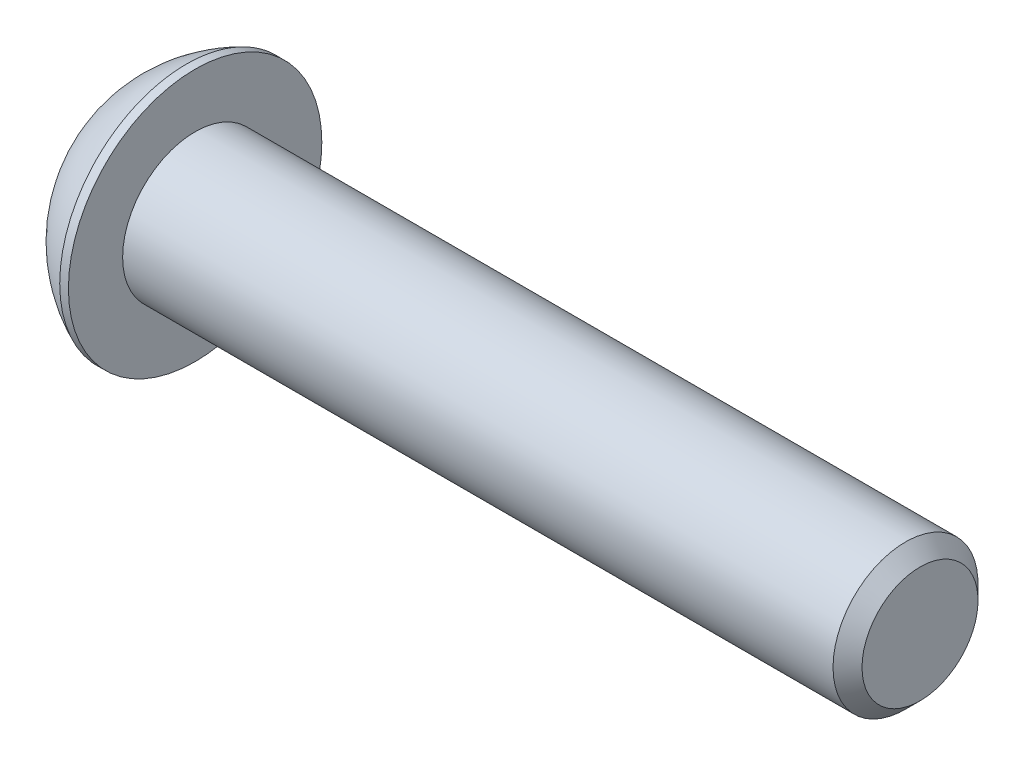
ISO-10303-21;
HEADER;
FILE_DESCRIPTION(('STEP AP214'),'2;1');
FILE_NAME('part.step','',(''),(''),'','','');
FILE_SCHEMA(('AUTOMOTIVE_DESIGN { 1 0 10303 214 1 1 1 1 }'));
ENDSEC;
DATA;
#1=APPLICATION_CONTEXT('core data for automotive mechanical design processes');
#2=APPLICATION_PROTOCOL_DEFINITION('international standard','automotive_design',2000,#1);
#3=PRODUCT_CONTEXT('',#1,'mechanical');
#4=PRODUCT('Part','Part','',(#3));
#5=PRODUCT_RELATED_PRODUCT_CATEGORY('part','',(#4));
#6=PRODUCT_DEFINITION_FORMATION('','',#4);
#7=PRODUCT_DEFINITION_CONTEXT('part definition',#1,'design');
#8=PRODUCT_DEFINITION('design','',#6,#7);
#9=PRODUCT_DEFINITION_SHAPE('','',#8);
#10=(LENGTH_UNIT() NAMED_UNIT(*) SI_UNIT(.MILLI.,.METRE.));
#11=(NAMED_UNIT(*) PLANE_ANGLE_UNIT() SI_UNIT($,.RADIAN.));
#12=(NAMED_UNIT(*) SI_UNIT($,.STERADIAN.) SOLID_ANGLE_UNIT());
#13=UNCERTAINTY_MEASURE_WITH_UNIT(LENGTH_MEASURE(1.E-05),#10,'distance_accuracy_value','');
#14=(GEOMETRIC_REPRESENTATION_CONTEXT(3) GLOBAL_UNCERTAINTY_ASSIGNED_CONTEXT((#13)) GLOBAL_UNIT_ASSIGNED_CONTEXT((#10,
#11,#12)) REPRESENTATION_CONTEXT('',''));
#15=CARTESIAN_POINT('',(0.,0.,0.));
#16=DIRECTION('',(0.,0.,1.));
#17=DIRECTION('',(1.,0.,0.));
#18=AXIS2_PLACEMENT_3D('',#15,#16,#17);
#19=CARTESIAN_POINT('',(1.32080000000034,0.,0.));
#20=DIRECTION('',(-1.,0.,0.));
#21=DIRECTION('',(0.,0.,1.));
#22=AXIS2_PLACEMENT_3D('',#19,#20,#21);
#23=CONICAL_SURFACE('',#22,1.1937999999998,1.04719755119608);
#24=CARTESIAN_POINT('',(2.01004075135902,0.,-4.44089209850063E-13));
#25=VERTEX_POINT('',#24);
#26=VERTEX_LOOP('',#25);
#27=FACE_BOUND('',#26,.T.);
#28=CARTESIAN_POINT('',(1.32080000000009,0.,0.));
#29=DIRECTION('',(-1.,0.,0.));
#30=DIRECTION('',(0.,0.,1.));
#31=AXIS2_PLACEMENT_3D('',#28,#29,#30);
#32=CIRCLE('',#31,1.19380000000024);
#33=CARTESIAN_POINT('',(1.32080000000009,0.,1.19380000000024));
#34=VERTEX_POINT('',#33);
#35=EDGE_CURVE('E20',#34,#34,#32,.T.);
#36=ORIENTED_EDGE('',*,*,#35,.T.);
#37=EDGE_LOOP('',(#36));
#38=FACE_BOUND('',#37,.T.);
#39=ADVANCED_FACE('F17',(#27,#38),#23,.F.);
#40=CARTESIAN_POINT('',(1.3208,-2.29135888084633,0.));
#41=DIRECTION('',(1.,0.,0.));
#42=DIRECTION('',(0.,0.,-1.));
#43=AXIS2_PLACEMENT_3D('',#40,#41,#42);
#44=PLANE('',#43);
#45=DIRECTION('',(0.,1.,0.));
#46=VECTOR('',#45,1.);
#47=CARTESIAN_POINT('',(1.3208,-1.14567944042316,1.984375));
#48=LINE('',#47,#46);
#49=CARTESIAN_POINT('',(1.3208,1.14567944042316,1.984375));
#50=VERTEX_POINT('',#49);
#51=CARTESIAN_POINT('',(1.3208,-1.14567944042316,1.984375));
#52=VERTEX_POINT('',#51);
#53=EDGE_CURVE('E69',#50,#52,#48,.F.);
#54=ORIENTED_EDGE('',*,*,#53,.F.);
#55=DIRECTION('',(0.,0.5,-0.866025403784439));
#56=VECTOR('',#55,1.);
#57=CARTESIAN_POINT('',(1.3208,1.14567944042316,1.984375));
#58=LINE('',#57,#56);
#59=CARTESIAN_POINT('',(1.3208,2.29135888084633,0.));
#60=VERTEX_POINT('',#59);
#61=EDGE_CURVE('E293',#60,#50,#58,.F.);
#62=ORIENTED_EDGE('',*,*,#61,.F.);
#63=DIRECTION('',(0.,-0.5,-0.866025403784439));
#64=VECTOR('',#63,1.);
#65=CARTESIAN_POINT('',(1.3208,2.29135888084633,0.));
#66=LINE('',#65,#64);
#67=CARTESIAN_POINT('',(1.3208,1.14567944042316,-1.984375));
#68=VERTEX_POINT('',#67);
#69=EDGE_CURVE('E297',#68,#60,#66,.F.);
#70=ORIENTED_EDGE('',*,*,#69,.F.);
#71=DIRECTION('',(0.,1.,0.));
#72=VECTOR('',#71,1.);
#73=CARTESIAN_POINT('',(1.3208,1.14567944042316,-1.984375));
#74=LINE('',#73,#72);
#75=CARTESIAN_POINT('',(1.3208,-1.14567944042316,-1.984375));
#76=VERTEX_POINT('',#75);
#77=EDGE_CURVE('E302',#76,#68,#74,.T.);
#78=ORIENTED_EDGE('',*,*,#77,.F.);
#79=DIRECTION('',(0.,-0.500000000000001,0.866025403784438));
#80=VECTOR('',#79,1.);
#81=CARTESIAN_POINT('',(1.3208,-1.14567944042316,-1.984375));
#82=LINE('',#81,#80);
#83=CARTESIAN_POINT('',(1.3208,-2.29135888084633,0.));
#84=VERTEX_POINT('',#83);
#85=EDGE_CURVE('E307',#84,#76,#82,.F.);
#86=ORIENTED_EDGE('',*,*,#85,.F.);
#87=DIRECTION('',(0.,0.500000000000001,0.866025403784438));
#88=VECTOR('',#87,1.);
#89=CARTESIAN_POINT('',(1.3208,-2.29135888084633,0.));
#90=LINE('',#89,#88);
#91=EDGE_CURVE('E82',#52,#84,#90,.F.);
#92=ORIENTED_EDGE('',*,*,#91,.F.);
#93=EDGE_LOOP('',(#54,#62,#70,#78,#86,#92));
#94=FACE_BOUND('',#93,.T.);
#95=ORIENTED_EDGE('',*,*,#35,.F.);
#96=EDGE_LOOP('',(#95));
#97=FACE_BOUND('',#96,.T.);
#98=ADVANCED_FACE('F75',(#94,#97),#44,.F.);
#99=CARTESIAN_POINT('',(1.3208,-1.14567944042316,1.984375));
#100=DIRECTION('',(0.,0.,-1.));
#101=DIRECTION('',(0.,1.,0.));
#102=AXIS2_PLACEMENT_3D('',#99,#100,#101);
#103=PLANE('',#102);
#104=ORIENTED_EDGE('',*,*,#53,.T.);
#105=DIRECTION('',(1.,0.,0.));
#106=VECTOR('',#105,1.);
#107=CARTESIAN_POINT('',(1.3208,-1.14567944042316,1.984375));
#108=LINE('',#107,#106);
#109=CARTESIAN_POINT('',(0.,-1.14567944042316,1.984375));
#110=VERTEX_POINT('',#109);
#111=EDGE_CURVE('E79',#110,#52,#108,.T.);
#112=ORIENTED_EDGE('',*,*,#111,.F.);
#113=DIRECTION('',(0.,1.,0.));
#114=VECTOR('',#113,1.);
#115=CARTESIAN_POINT('',(0.,0.,1.984375));
#116=LINE('',#115,#114);
#117=CARTESIAN_POINT('',(0.,1.14567944042316,1.984375));
#118=VERTEX_POINT('',#117);
#119=EDGE_CURVE('E287',#118,#110,#116,.F.);
#120=ORIENTED_EDGE('',*,*,#119,.F.);
#121=DIRECTION('',(1.,0.,0.));
#122=VECTOR('',#121,1.);
#123=CARTESIAN_POINT('',(1.3208,1.14567944042316,1.984375));
#124=LINE('',#123,#122);
#125=EDGE_CURVE('E290',#50,#118,#124,.F.);
#126=ORIENTED_EDGE('',*,*,#125,.F.);
#127=EDGE_LOOP('',(#104,#112,#120,#126));
#128=FACE_BOUND('',#127,.T.);
#129=ADVANCED_FACE('F129',(#128),#103,.T.);
#130=CARTESIAN_POINT('',(1.3208,-2.29135888084633,0.));
#131=DIRECTION('',(0.,0.866025403784438,-0.500000000000001));
#132=DIRECTION('',(0.,0.500000000000001,0.866025403784438));
#133=AXIS2_PLACEMENT_3D('',#130,#131,#132);
#134=PLANE('',#133);
#135=ORIENTED_EDGE('',*,*,#91,.T.);
#136=DIRECTION('',(1.,0.,0.));
#137=VECTOR('',#136,1.);
#138=CARTESIAN_POINT('',(1.3208,-2.29135888084633,0.));
#139=LINE('',#138,#137);
#140=CARTESIAN_POINT('',(0.,-2.29135888084633,0.));
#141=VERTEX_POINT('',#140);
#142=EDGE_CURVE('E309',#141,#84,#139,.T.);
#143=ORIENTED_EDGE('',*,*,#142,.F.);
#144=DIRECTION('',(0.,-0.500000000000001,-0.866025403784438));
#145=VECTOR('',#144,1.);
#146=CARTESIAN_POINT('',(0.,-1.14567944042316,1.984375));
#147=LINE('',#146,#145);
#148=EDGE_CURVE('E284',#110,#141,#147,.T.);
#149=ORIENTED_EDGE('',*,*,#148,.F.);
#150=ORIENTED_EDGE('',*,*,#111,.T.);
#151=EDGE_LOOP('',(#135,#143,#149,#150));
#152=FACE_BOUND('',#151,.T.);
#153=ADVANCED_FACE('F125',(#152),#134,.T.);
#154=CARTESIAN_POINT('',(1.3208,-1.14567944042316,-1.984375));
#155=DIRECTION('',(0.,0.866025403784438,0.500000000000001));
#156=DIRECTION('',(0.,-0.500000000000001,0.866025403784438));
#157=AXIS2_PLACEMENT_3D('',#154,#155,#156);
#158=PLANE('',#157);
#159=ORIENTED_EDGE('',*,*,#85,.T.);
#160=DIRECTION('',(1.,0.,0.));
#161=VECTOR('',#160,1.);
#162=CARTESIAN_POINT('',(1.3208,-1.14567944042316,-1.984375));
#163=LINE('',#162,#161);
#164=CARTESIAN_POINT('',(0.,-1.14567944042316,-1.984375));
#165=VERTEX_POINT('',#164);
#166=EDGE_CURVE('E304',#165,#76,#163,.T.);
#167=ORIENTED_EDGE('',*,*,#166,.F.);
#168=DIRECTION('',(0.,0.500000000000001,-0.866025403784438));
#169=VECTOR('',#168,1.);
#170=CARTESIAN_POINT('',(0.,-2.29135888084633,0.));
#171=LINE('',#170,#169);
#172=EDGE_CURVE('E281',#141,#165,#171,.T.);
#173=ORIENTED_EDGE('',*,*,#172,.F.);
#174=ORIENTED_EDGE('',*,*,#142,.T.);
#175=EDGE_LOOP('',(#159,#167,#173,#174));
#176=FACE_BOUND('',#175,.T.);
#177=ADVANCED_FACE('F121',(#176),#158,.T.);
#178=CARTESIAN_POINT('',(1.3208,1.14567944042316,-1.984375));
#179=DIRECTION('',(0.,0.,1.));
#180=DIRECTION('',(1.,0.,0.));
#181=AXIS2_PLACEMENT_3D('',#178,#179,#180);
#182=PLANE('',#181);
#183=ORIENTED_EDGE('',*,*,#77,.T.);
#184=DIRECTION('',(1.,0.,0.));
#185=VECTOR('',#184,1.);
#186=CARTESIAN_POINT('',(1.3208,1.14567944042316,-1.984375));
#187=LINE('',#186,#185);
#188=CARTESIAN_POINT('',(0.,1.14567944042316,-1.984375));
#189=VERTEX_POINT('',#188);
#190=EDGE_CURVE('E299',#189,#68,#187,.T.);
#191=ORIENTED_EDGE('',*,*,#190,.F.);
#192=DIRECTION('',(0.,1.,0.));
#193=VECTOR('',#192,1.);
#194=CARTESIAN_POINT('',(0.,0.,-1.984375));
#195=LINE('',#194,#193);
#196=EDGE_CURVE('E278',#165,#189,#195,.T.);
#197=ORIENTED_EDGE('',*,*,#196,.F.);
#198=ORIENTED_EDGE('',*,*,#166,.T.);
#199=EDGE_LOOP('',(#183,#191,#197,#198));
#200=FACE_BOUND('',#199,.T.);
#201=ADVANCED_FACE('F118',(#200),#182,.T.);
#202=CARTESIAN_POINT('',(1.3208,2.29135888084633,0.));
#203=DIRECTION('',(0.,-0.866025403784439,0.5));
#204=DIRECTION('',(0.,-0.5,-0.866025403784439));
#205=AXIS2_PLACEMENT_3D('',#202,#203,#204);
#206=PLANE('',#205);
#207=ORIENTED_EDGE('',*,*,#69,.T.);
#208=DIRECTION('',(1.,0.,0.));
#209=VECTOR('',#208,1.);
#210=CARTESIAN_POINT('',(1.3208,2.29135888084633,0.));
#211=LINE('',#210,#209);
#212=CARTESIAN_POINT('',(0.,2.29135888084633,0.));
#213=VERTEX_POINT('',#212);
#214=EDGE_CURVE('E35',#213,#60,#211,.T.);
#215=ORIENTED_EDGE('',*,*,#214,.F.);
#216=DIRECTION('',(0.,0.5,0.866025403784439));
#217=VECTOR('',#216,1.);
#218=CARTESIAN_POINT('',(0.,1.14567944042316,-1.984375));
#219=LINE('',#218,#217);
#220=EDGE_CURVE('E275',#189,#213,#219,.T.);
#221=ORIENTED_EDGE('',*,*,#220,.F.);
#222=ORIENTED_EDGE('',*,*,#190,.T.);
#223=EDGE_LOOP('',(#207,#215,#221,#222));
#224=FACE_BOUND('',#223,.T.);
#225=ADVANCED_FACE('F114',(#224),#206,.T.);
#226=CARTESIAN_POINT('',(1.3208,1.14567944042316,1.984375));
#227=DIRECTION('',(0.,-0.866025403784439,-0.5));
#228=DIRECTION('',(0.,0.5,-0.866025403784439));
#229=AXIS2_PLACEMENT_3D('',#226,#227,#228);
#230=PLANE('',#229);
#231=ORIENTED_EDGE('',*,*,#61,.T.);
#232=ORIENTED_EDGE('',*,*,#125,.T.);
#233=DIRECTION('',(0.,-0.5,0.866025403784438));
#234=VECTOR('',#233,1.);
#235=CARTESIAN_POINT('',(0.,2.29135888084633,0.));
#236=LINE('',#235,#234);
#237=EDGE_CURVE('E101',#213,#118,#236,.T.);
#238=ORIENTED_EDGE('',*,*,#237,.F.);
#239=ORIENTED_EDGE('',*,*,#214,.T.);
#240=EDGE_LOOP('',(#231,#232,#238,#239));
#241=FACE_BOUND('',#240,.T.);
#242=ADVANCED_FACE('F110',(#241),#230,.T.);
#243=CARTESIAN_POINT('',(0.,0.,0.));
#244=DIRECTION('',(-1.,0.,0.));
#245=DIRECTION('',(0.,0.,1.));
#246=AXIS2_PLACEMENT_3D('',#243,#244,#245);
#247=PLANE('',#246);
#248=ORIENTED_EDGE('',*,*,#220,.T.);
#249=ORIENTED_EDGE('',*,*,#237,.T.);
#250=ORIENTED_EDGE('',*,*,#119,.T.);
#251=ORIENTED_EDGE('',*,*,#148,.T.);
#252=ORIENTED_EDGE('',*,*,#172,.T.);
#253=ORIENTED_EDGE('',*,*,#196,.T.);
#254=EDGE_LOOP('',(#248,#249,#250,#251,#252,#253));
#255=FACE_BOUND('',#254,.T.);
#256=CARTESIAN_POINT('',(0.,2.77495,0.));
#257=CARTESIAN_POINT('',(0.,2.77494953309947,0.0779118937523459));
#258=CARTESIAN_POINT('',(0.,2.77166578388025,0.15583810591977));
#259=CARTESIAN_POINT('',(0.,2.75855213600204,0.311152012455904));
#260=CARTESIAN_POINT('',(0.,2.74872030471467,0.388539541019556));
#261=CARTESIAN_POINT('',(0.,2.72255472645676,0.542341518735717));
#262=CARTESIAN_POINT('',(-2.70414110576258E-13,2.70621065843663,0.618754223567578));
#263=CARTESIAN_POINT('',(2.71501725221868E-13,2.66713326915777,0.769973634286023));
#264=CARTESIAN_POINT('',(1.01274952524446E-12,2.64439476297869,0.844778983646282));
#265=CARTESIAN_POINT('',(1.81909959813207E-12,2.56690195943351,1.06566239301792));
#266=CARTESIAN_POINT('',(4.77081687541822E-13,2.50280672569928,1.20857954243987));
#267=CARTESIAN_POINT('',(-4.76232447128612E-13,2.35149826934097,1.48160874561538));
#268=CARTESIAN_POINT('',(0.,2.26428416790397,1.61172031233499));
#269=CARTESIAN_POINT('',(0.,2.1181093928834,1.79445660654268));
#270=CARTESIAN_POINT('',(0.,2.06678693791626,1.85333128513996));
#271=CARTESIAN_POINT('',(0.,1.95940522984449,1.96650727912792));
#272=CARTESIAN_POINT('',(0.,1.90335059143535,2.02081294920044));
#273=CARTESIAN_POINT('',(0.,1.78683891013963,2.12453280878582));
#274=CARTESIAN_POINT('',(0.,1.72637988450322,2.1739447713554));
#275=CARTESIAN_POINT('',(0.,1.60151968865711,2.26750481692908));
#276=CARTESIAN_POINT('',(0.,1.53711760864537,2.31165167810847));
#277=CARTESIAN_POINT('',(0.,1.33869902291632,2.43567242603944));
#278=CARTESIAN_POINT('',(0.,1.19934704110695,2.507235886628));
#279=CARTESIAN_POINT('',(0.,0.910681609121881,2.62590828672821));
#280=CARTESIAN_POINT('',(0.,0.761368265357398,2.67301748742278));
#281=CARTESIAN_POINT('',(0.,0.456932649466623,2.74151230664007));
#282=CARTESIAN_POINT('',(0.,0.301810346322584,2.76289778778721));
#283=CARTESIAN_POINT('',(0.,-0.00982263870895171,2.77931595661156));
#284=CARTESIAN_POINT('',(0.,-0.166333320596448,2.77434864428877));
#285=CARTESIAN_POINT('',(0.,-0.476280836814452,2.73822217653073));
#286=CARTESIAN_POINT('',(0.,-0.629717687555985,2.70706316096981));
#287=CARTESIAN_POINT('',(0.,-0.929254830044274,2.61937980771149));
#288=CARTESIAN_POINT('',(0.,-1.0753550434132,2.56285519909568));
#289=CARTESIAN_POINT('',(0.,-1.28570692598579,2.46037024128109));
#290=CARTESIAN_POINT('',(0.,-1.35439130022287,2.42323494812896));
#291=CARTESIAN_POINT('',(0.,-1.488391287199,2.34331277270256));
#292=CARTESIAN_POINT('',(0.,-1.55370767631787,2.30052720108831));
#293=CARTESIAN_POINT('',(0.,-1.68047292776594,2.20962421887055));
#294=CARTESIAN_POINT('',(0.,-1.7419235278682,2.16150923122348));
#295=CARTESIAN_POINT('',(0.,-1.86060297067992,2.06024311301283));
#296=CARTESIAN_POINT('',(0.,-1.91782768181715,2.0070871669763));
#297=CARTESIAN_POINT('',(0.,-2.08239462196651,1.8407220856554));
#298=CARTESIAN_POINT('',(0.,-2.18279764272601,1.72049499758422));
#299=CARTESIAN_POINT('',(0.,-2.36195754944063,1.46487629213018));
#300=CARTESIAN_POINT('',(0.,-2.44071525816758,1.32948525142807));
#301=CARTESIAN_POINT('',(0.,-2.54098882695274,1.11796734074395));
#302=CARTESIAN_POINT('',(0.,-2.57146177392727,1.04596540008347));
#303=CARTESIAN_POINT('',(0.,-2.62621251108999,0.899689259475764));
#304=CARTESIAN_POINT('',(0.,-2.65049531495563,0.825416953360952));
#305=CARTESIAN_POINT('',(0.,-2.69267708798766,0.675215808695207));
#306=CARTESIAN_POINT('',(0.,-2.71058613777937,0.599289789313092));
#307=CARTESIAN_POINT('',(0.,-2.73994710360127,0.446213628496932));
#308=CARTESIAN_POINT('',(0.,-2.75140092413871,0.369063855024788));
#309=CARTESIAN_POINT('',(0.,-2.76470470685522,0.24316208817343));
#310=CARTESIAN_POINT('',(0.,-2.76854547596618,0.194611672428577));
#311=CARTESIAN_POINT('',(0.,-2.77366826843264,0.0973760351839812));
#312=CARTESIAN_POINT('',(0.,-2.77495029178814,0.0486908136842395));
#313=CARTESIAN_POINT('',(0.,-2.77494953309947,-0.0779118937523475));
#314=CARTESIAN_POINT('',(0.,-2.77166578388025,-0.155838105919772));
#315=CARTESIAN_POINT('',(0.,-2.75855213600204,-0.311152012455906));
#316=CARTESIAN_POINT('',(0.,-2.74872030471467,-0.388539541019558));
#317=CARTESIAN_POINT('',(0.,-2.72255472645677,-0.542341518735719));
#318=CARTESIAN_POINT('',(-2.70149297926331E-13,-2.70621065843663,-0.61875422356758));
#319=CARTESIAN_POINT('',(2.712366972268E-13,-2.66713326915777,-0.769973634286024));
#320=CARTESIAN_POINT('',(1.0114146773846E-12,-2.64439476297869,-0.844778983646283));
#321=CARTESIAN_POINT('',(1.81656702958366E-12,-2.5669019594335,-1.06566239301792));
#322=CARTESIAN_POINT('',(4.7641829195856E-13,-2.50280672569928,-1.20857954243988));
#323=CARTESIAN_POINT('',(-4.75569026324205E-13,-2.35149826934097,-1.48160874561538));
#324=CARTESIAN_POINT('',(0.,-2.26428416790396,-1.61172031233499));
#325=CARTESIAN_POINT('',(0.,-2.1181093928834,-1.79445660654268));
#326=CARTESIAN_POINT('',(0.,-2.06678693791626,-1.85333128513997));
#327=CARTESIAN_POINT('',(0.,-1.95940522984449,-1.96650727912792));
#328=CARTESIAN_POINT('',(0.,-1.90335059143535,-2.02081294920044));
#329=CARTESIAN_POINT('',(0.,-1.78683891013963,-2.12453280878582));
#330=CARTESIAN_POINT('',(0.,-1.72637988450322,-2.1739447713554));
#331=CARTESIAN_POINT('',(0.,-1.60151968865711,-2.26750481692908));
#332=CARTESIAN_POINT('',(0.,-1.53711760864537,-2.31165167810847));
#333=CARTESIAN_POINT('',(0.,-1.33869902291632,-2.43567242603944));
#334=CARTESIAN_POINT('',(0.,-1.19934704110695,-2.507235886628));
#335=CARTESIAN_POINT('',(0.,-0.91068160912188,-2.62590828672821));
#336=CARTESIAN_POINT('',(0.,-0.761368265357396,-2.67301748742278));
#337=CARTESIAN_POINT('',(0.,-0.456932649466621,-2.74151230664007));
#338=CARTESIAN_POINT('',(0.,-0.301810346322582,-2.76289778778721));
#339=CARTESIAN_POINT('',(0.,0.00982263870895353,-2.77931595661156));
#340=CARTESIAN_POINT('',(0.,0.16633332059645,-2.77434864428876));
#341=CARTESIAN_POINT('',(0.,0.476280836814454,-2.73822217653073));
#342=CARTESIAN_POINT('',(0.,0.629717687555987,-2.70706316096981));
#343=CARTESIAN_POINT('',(0.,0.929254830044276,-2.6193798077115));
#344=CARTESIAN_POINT('',(0.,1.0753550434132,-2.56285519909568));
#345=CARTESIAN_POINT('',(0.,1.28570692598579,-2.46037024128109));
#346=CARTESIAN_POINT('',(0.,1.35439130022287,-2.42323494812896));
#347=CARTESIAN_POINT('',(0.,1.488391287199,-2.34331277270256));
#348=CARTESIAN_POINT('',(0.,1.55370767631787,-2.30052720108831));
#349=CARTESIAN_POINT('',(0.,1.68047292776594,-2.20962421887055));
#350=CARTESIAN_POINT('',(0.,1.7419235278682,-2.16150923122348));
#351=CARTESIAN_POINT('',(0.,1.86060297067992,-2.06024311301282));
#352=CARTESIAN_POINT('',(0.,1.91782768181716,-2.0070871669763));
#353=CARTESIAN_POINT('',(0.,2.08239462196651,-1.8407220856554));
#354=CARTESIAN_POINT('',(0.,2.18279764272601,-1.72049499758422));
#355=CARTESIAN_POINT('',(0.,2.36195754944063,-1.46487629213018));
#356=CARTESIAN_POINT('',(0.,2.44071525816757,-1.32948525142807));
#357=CARTESIAN_POINT('',(0.,2.54098882695273,-1.11796734074395));
#358=CARTESIAN_POINT('',(0.,2.57146177392727,-1.04596540008347));
#359=CARTESIAN_POINT('',(0.,2.62621251108999,-0.899689259475765));
#360=CARTESIAN_POINT('',(0.,2.65049531495563,-0.825416953360953));
#361=CARTESIAN_POINT('',(0.,2.69267708798766,-0.675215808695207));
#362=CARTESIAN_POINT('',(0.,2.71058613777936,-0.599289789313092));
#363=CARTESIAN_POINT('',(0.,2.73994710360127,-0.446213628496932));
#364=CARTESIAN_POINT('',(0.,2.75140092413871,-0.369063855024789));
#365=CARTESIAN_POINT('',(0.,2.76470470685522,-0.243162088173432));
#366=CARTESIAN_POINT('',(0.,2.76854547596618,-0.194611672428578));
#367=CARTESIAN_POINT('',(0.,2.77366826843264,-0.0973760351839823));
#368=CARTESIAN_POINT('',(0.,2.77495029178814,-0.0486908136842408));
#369=CARTESIAN_POINT('',(0.,2.77495,0.));
#370=B_SPLINE_CURVE_WITH_KNOTS('',3,(#256,#257,#258,#259,#260,#261,#262,#263,#264,#265,#266,
#267,#268,#269,#270,#271,#272,#273,#274,#275,#276,#277,#278,#279,#280,#281,#282,#283,#284,#285,
#286,#287,#288,#289,#290,#291,#292,#293,#294,#295,#296,#297,#298,#299,#300,#301,#302,#303,#304,
#305,#306,#307,#308,#309,#310,#311,#312,#313,#314,#315,#316,#317,#318,#319,#320,#321,#322,#323,
#324,#325,#326,#327,#328,#329,#330,#331,#332,#333,#334,#335,#336,#337,#338,#339,#340,#341,#342,
#343,#344,#345,#346,#347,#348,#349,#350,#351,#352,#353,#354,#355,#356,#357,#358,#359,#360,#361,
#362,#363,#364,#365,#366,#367,#368,#369),.UNSPECIFIED.,.T.,.F.,(4,2,2,2,2,2,2,2,2,2,2,2,2,2,2,2,
2,2,2,2,2,2,2,2,2,2,2,2,2,2,2,2,2,2,2,2,2,2,2,2,2,2,2,2,2,2,2,2,2,2,2,2,2,2,2,2,4),(0.,
0.233690856748162,0.467450716578751,0.701582538521471,0.935904756015414,1.40343220467667,
1.87097742791502,2.10505636898837,2.33890962270652,2.57286880998746,2.80688218486306,
3.27442101763127,3.74195485676357,4.20949119271389,4.67702752866417,5.14456136779641,
5.61210020056468,5.84611357544033,6.08007276272136,6.31392601643949,6.54800495751273,
7.01555018075072,7.48307762941212,7.71739984690652,7.95153166884955,8.18529152868023,
8.41898238542855,8.56502681353347,8.71107124163843,8.94476209838659,9.17852195821718,
9.4126537801599,9.64697599765384,10.1145034463151,10.5820486695534,10.8161276106268,
11.0499808643449,11.2839400516259,11.5179534265015,11.9854922592697,12.453026098402,
12.9205624343523,13.3880987703026,13.8556326094348,14.3231714422031,14.5571848170788,
14.7911440043598,15.0249972580779,15.2590761991512,15.7266214223891,16.1941488710506,
16.4284710885449,16.662602910488,16.8963627703186,17.130053627067,17.2760980551719,
17.4221424832769),.UNSPECIFIED.);
#371=CARTESIAN_POINT('',(0.,2.77495,0.));
#372=VERTEX_POINT('',#371);
#373=EDGE_CURVE('E94',#372,#372,#370,.T.);
#374=ORIENTED_EDGE('',*,*,#373,.F.);
#375=EDGE_LOOP('',(#374));
#376=FACE_BOUND('',#375,.T.);
#377=ADVANCED_FACE('F106',(#255,#376),#247,.T.);
#378=CARTESIAN_POINT('',(5.37260881410256,0.,0.));
#379=DIRECTION('',(0.,1.,0.));
#380=DIRECTION('',(1.,0.,0.));
#381=AXIS2_PLACEMENT_3D('',#378,#379,#380);
#382=SPHERICAL_SURFACE('',#381,6.04692260342999);
#383=CARTESIAN_POINT('',(2.9718,0.,0.));
#384=DIRECTION('',(-1.,0.,0.));
#385=DIRECTION('',(0.,0.,1.));
#386=AXIS2_PLACEMENT_3D('',#383,#384,#385);
#387=CIRCLE('',#386,5.5499);
#388=CARTESIAN_POINT('',(2.9718,0.,5.5499));
#389=VERTEX_POINT('',#388);
#390=EDGE_CURVE('E92',#389,#389,#387,.F.);
#391=ORIENTED_EDGE('',*,*,#390,.F.);
#392=EDGE_LOOP('',(#391));
#393=FACE_BOUND('',#392,.T.);
#394=ORIENTED_EDGE('',*,*,#373,.T.);
#395=EDGE_LOOP('',(#394));
#396=FACE_BOUND('',#395,.T.);
#397=ADVANCED_FACE('F102',(#393,#396),#382,.T.);
#398=CARTESIAN_POINT('',(35.1028,0.,0.));
#399=DIRECTION('',(-1.,0.,0.));
#400=DIRECTION('',(0.,0.,1.));
#401=AXIS2_PLACEMENT_3D('',#398,#399,#400);
#402=PLANE('',#401);
#403=CARTESIAN_POINT('',(35.1028000000611,0.,0.));
#404=DIRECTION('',(-1.,0.,0.));
#405=DIRECTION('',(0.,0.,1.));
#406=AXIS2_PLACEMENT_3D('',#403,#404,#405);
#407=CIRCLE('',#406,2.53999999995358);
#408=CARTESIAN_POINT('',(35.1028000000611,0.,2.53999999995358));
#409=VERTEX_POINT('',#408);
#410=EDGE_CURVE('E89',#409,#409,#407,.T.);
#411=ORIENTED_EDGE('',*,*,#410,.F.);
#412=EDGE_LOOP('',(#411));
#413=FACE_BOUND('',#412,.T.);
#414=ADVANCED_FACE('F155',(#413),#402,.F.);
#415=CARTESIAN_POINT('',(0.,0.,0.));
#416=DIRECTION('',(-1.,0.,0.));
#417=DIRECTION('',(0.,0.,1.));
#418=AXIS2_PLACEMENT_3D('',#415,#416,#417);
#419=CYLINDRICAL_SURFACE('',#418,5.5499);
#420=ORIENTED_EDGE('',*,*,#390,.T.);
#421=EDGE_LOOP('',(#420));
#422=FACE_BOUND('',#421,.T.);
#423=CARTESIAN_POINT('',(3.3528,0.,0.));
#424=DIRECTION('',(-1.,0.,0.));
#425=DIRECTION('',(0.,0.,1.));
#426=AXIS2_PLACEMENT_3D('',#423,#424,#425);
#427=CIRCLE('',#426,5.5499);
#428=CARTESIAN_POINT('',(3.3528,0.,5.5499));
#429=VERTEX_POINT('',#428);
#430=EDGE_CURVE('E86',#429,#429,#427,.T.);
#431=ORIENTED_EDGE('',*,*,#430,.T.);
#432=EDGE_LOOP('',(#431));
#433=FACE_BOUND('',#432,.T.);
#434=ADVANCED_FACE('F152',(#422,#433),#419,.T.);
#435=CARTESIAN_POINT('',(34.4678000000158,0.,0.));
#436=DIRECTION('',(-1.,0.,0.));
#437=DIRECTION('',(0.,0.,1.));
#438=AXIS2_PLACEMENT_3D('',#435,#436,#437);
#439=CONICAL_SURFACE('',#438,3.17499999999882,0.785398163397448);
#440=CARTESIAN_POINT('',(34.4678,0.,0.));
#441=DIRECTION('',(-1.,0.,0.));
#442=DIRECTION('',(0.,0.,1.));
#443=AXIS2_PLACEMENT_3D('',#440,#441,#442);
#444=CIRCLE('',#443,3.175);
#445=CARTESIAN_POINT('',(34.4678,0.,3.175));
#446=VERTEX_POINT('',#445);
#447=EDGE_CURVE('E26',#446,#446,#444,.T.);
#448=ORIENTED_EDGE('',*,*,#447,.F.);
#449=EDGE_LOOP('',(#448));
#450=FACE_BOUND('',#449,.T.);
#451=ORIENTED_EDGE('',*,*,#410,.T.);
#452=EDGE_LOOP('',(#451));
#453=FACE_BOUND('',#452,.T.);
#454=ADVANCED_FACE('F145',(#450,#453),#439,.T.);
#455=CARTESIAN_POINT('',(3.3528,3.175,0.));
#456=DIRECTION('',(-1.,0.,0.));
#457=DIRECTION('',(0.,0.,1.));
#458=AXIS2_PLACEMENT_3D('',#455,#456,#457);
#459=PLANE('',#458);
#460=CARTESIAN_POINT('',(3.3528,0.,0.));
#461=DIRECTION('',(-1.,0.,0.));
#462=DIRECTION('',(0.,0.,1.));
#463=AXIS2_PLACEMENT_3D('',#460,#461,#462);
#464=CIRCLE('',#463,3.175);
#465=CARTESIAN_POINT('',(3.3528,0.,3.175));
#466=VERTEX_POINT('',#465);
#467=EDGE_CURVE('E11',#466,#466,#464,.F.);
#468=ORIENTED_EDGE('',*,*,#467,.F.);
#469=EDGE_LOOP('',(#468));
#470=FACE_BOUND('',#469,.T.);
#471=ORIENTED_EDGE('',*,*,#430,.F.);
#472=EDGE_LOOP('',(#471));
#473=FACE_BOUND('',#472,.T.);
#474=ADVANCED_FACE('F139',(#470,#473),#459,.F.);
#475=CARTESIAN_POINT('',(0.,0.,0.));
#476=DIRECTION('',(-1.,0.,0.));
#477=DIRECTION('',(0.,0.,1.));
#478=AXIS2_PLACEMENT_3D('',#475,#476,#477);
#479=CYLINDRICAL_SURFACE('',#478,3.175);
#480=ORIENTED_EDGE('',*,*,#467,.T.);
#481=EDGE_LOOP('',(#480));
#482=FACE_BOUND('',#481,.T.);
#483=ORIENTED_EDGE('',*,*,#447,.T.);
#484=EDGE_LOOP('',(#483));
#485=FACE_BOUND('',#484,.T.);
#486=ADVANCED_FACE('F137',(#482,#485),#479,.T.);
#487=CLOSED_SHELL('',(#39,#98,#129,#153,#177,#201,#225,#242,#377,#397,#414,#434,#454,#474,#486));
#488=MANIFOLD_SOLID_BREP('B1',#487);
#489=ADVANCED_BREP_SHAPE_REPRESENTATION('',(#18,#488),#14);
#490=SHAPE_DEFINITION_REPRESENTATION(#9,#489);
ENDSEC;
END-ISO-10303-21;
